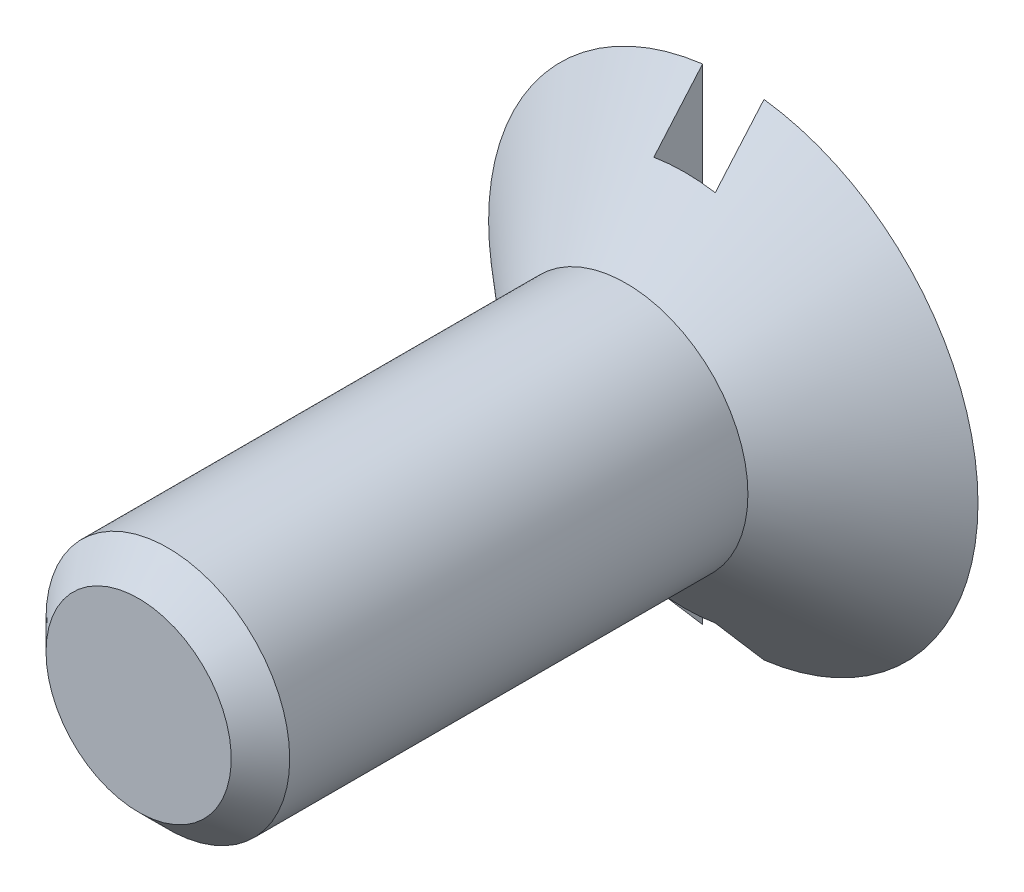
ISO-10303-21;
HEADER;
FILE_DESCRIPTION(('STEP AP214'),'2;1');
FILE_NAME('part.step','',(''),(''),'','','');
FILE_SCHEMA(('AUTOMOTIVE_DESIGN { 1 0 10303 214 1 1 1 1 }'));
ENDSEC;
DATA;
#1=APPLICATION_CONTEXT('core data for automotive mechanical design processes');
#2=APPLICATION_PROTOCOL_DEFINITION('international standard','automotive_design',2000,#1);
#3=PRODUCT_CONTEXT('',#1,'mechanical');
#4=PRODUCT('Part','Part','',(#3));
#5=PRODUCT_RELATED_PRODUCT_CATEGORY('part','',(#4));
#6=PRODUCT_DEFINITION_FORMATION('','',#4);
#7=PRODUCT_DEFINITION_CONTEXT('part definition',#1,'design');
#8=PRODUCT_DEFINITION('design','',#6,#7);
#9=PRODUCT_DEFINITION_SHAPE('','',#8);
#10=(LENGTH_UNIT() NAMED_UNIT(*) SI_UNIT(.MILLI.,.METRE.));
#11=(NAMED_UNIT(*) PLANE_ANGLE_UNIT() SI_UNIT($,.RADIAN.));
#12=(NAMED_UNIT(*) SI_UNIT($,.STERADIAN.) SOLID_ANGLE_UNIT());
#13=UNCERTAINTY_MEASURE_WITH_UNIT(LENGTH_MEASURE(1.E-05),#10,'distance_accuracy_value','');
#14=(GEOMETRIC_REPRESENTATION_CONTEXT(3) GLOBAL_UNCERTAINTY_ASSIGNED_CONTEXT((#13)) GLOBAL_UNIT_ASSIGNED_CONTEXT((#10,
#11,#12)) REPRESENTATION_CONTEXT('',''));
#15=CARTESIAN_POINT('',(0.,0.,0.));
#16=DIRECTION('',(0.,0.,1.));
#17=DIRECTION('',(1.,0.,0.));
#18=AXIS2_PLACEMENT_3D('',#15,#16,#17);
#19=CARTESIAN_POINT('',(0.,0.,-14.732));
#20=DIRECTION('',(0.,0.,1.));
#21=DIRECTION('',(1.,0.,0.));
#22=AXIS2_PLACEMENT_3D('',#19,#20,#21);
#23=PLANE('',#22);
#24=CARTESIAN_POINT('',(0.,0.,-14.732));
#25=DIRECTION('',(0.,0.,-1.));
#26=DIRECTION('',(-1.,0.,0.));
#27=AXIS2_PLACEMENT_3D('',#24,#25,#26);
#28=CIRCLE('',#27,6.3754);
#29=CARTESIAN_POINT('',(0.800099999999999,6.32499526877293,-14.732));
#30=VERTEX_POINT('',#29);
#31=CARTESIAN_POINT('',(0.800099999999999,-6.32499526877293,-14.732));
#32=VERTEX_POINT('',#31);
#33=EDGE_CURVE('E109',#30,#32,#28,.T.);
#34=ORIENTED_EDGE('',*,*,#33,.T.);
#35=DIRECTION('',(0.,1.,0.));
#36=VECTOR('',#35,1.);
#37=CARTESIAN_POINT('',(0.800099999999999,0.,-14.732));
#38=LINE('',#37,#36);
#39=EDGE_CURVE('E95',#32,#30,#38,.T.);
#40=ORIENTED_EDGE('',*,*,#39,.T.);
#41=EDGE_LOOP('',(#34,#40));
#42=FACE_BOUND('',#41,.T.);
#43=ADVANCED_FACE('F45',(#42),#23,.F.);
#44=CARTESIAN_POINT('',(0.,0.,0.762));
#45=DIRECTION('',(0.,0.,-1.));
#46=DIRECTION('',(-1.,0.,0.));
#47=AXIS2_PLACEMENT_3D('',#44,#45,#46);
#48=PLANE('',#47);
#49=CARTESIAN_POINT('',(0.,0.,0.762));
#50=DIRECTION('',(0.,0.,-1.));
#51=DIRECTION('',(-1.,0.,0.));
#52=AXIS2_PLACEMENT_3D('',#49,#50,#51);
#53=CIRCLE('',#52,2.413);
#54=CARTESIAN_POINT('',(-2.413,0.,0.762000000000001));
#55=VERTEX_POINT('',#54);
#56=EDGE_CURVE('E96',#55,#55,#53,.T.);
#57=ORIENTED_EDGE('',*,*,#56,.F.);
#58=EDGE_LOOP('',(#57));
#59=FACE_BOUND('',#58,.T.);
#60=ADVANCED_FACE('F47',(#59),#48,.F.);
#61=CARTESIAN_POINT('',(0.,0.,0.762));
#62=DIRECTION('',(0.,0.,-1.));
#63=DIRECTION('',(-1.,0.,0.));
#64=AXIS2_PLACEMENT_3D('',#61,#62,#63);
#65=CONICAL_SURFACE('',#64,2.413,0.785398163397448);
#66=CARTESIAN_POINT('',(0.,0.,0.));
#67=DIRECTION('',(0.,0.,-1.));
#68=DIRECTION('',(-1.,0.,0.));
#69=AXIS2_PLACEMENT_3D('',#66,#67,#68);
#70=CIRCLE('',#69,3.175);
#71=CARTESIAN_POINT('',(-3.175,0.,0.));
#72=VERTEX_POINT('',#71);
#73=EDGE_CURVE('E127',#72,#72,#70,.T.);
#74=ORIENTED_EDGE('',*,*,#73,.F.);
#75=EDGE_LOOP('',(#74));
#76=FACE_BOUND('',#75,.T.);
#77=ORIENTED_EDGE('',*,*,#56,.T.);
#78=EDGE_LOOP('',(#77));
#79=FACE_BOUND('',#78,.T.);
#80=ADVANCED_FACE('F170',(#76,#79),#65,.T.);
#81=CARTESIAN_POINT('',(0.,0.,0.));
#82=DIRECTION('',(0.,0.,-1.));
#83=DIRECTION('',(-1.,0.,0.));
#84=AXIS2_PLACEMENT_3D('',#81,#82,#83);
#85=CYLINDRICAL_SURFACE('',#84,3.175);
#86=CARTESIAN_POINT('',(0.,0.,-11.938));
#87=DIRECTION('',(0.,0.,-1.));
#88=DIRECTION('',(-1.,0.,0.));
#89=AXIS2_PLACEMENT_3D('',#86,#87,#88);
#90=CIRCLE('',#89,3.175);
#91=CARTESIAN_POINT('',(-3.175,0.,-11.938));
#92=VERTEX_POINT('',#91);
#93=EDGE_CURVE('E115',#92,#92,#90,.T.);
#94=ORIENTED_EDGE('',*,*,#93,.F.);
#95=EDGE_LOOP('',(#94));
#96=FACE_BOUND('',#95,.T.);
#97=ORIENTED_EDGE('',*,*,#73,.T.);
#98=EDGE_LOOP('',(#97));
#99=FACE_BOUND('',#98,.T.);
#100=ADVANCED_FACE('F164',(#96,#99),#85,.T.);
#101=CARTESIAN_POINT('',(0.,0.,-11.938));
#102=DIRECTION('',(0.,0.,-1.));
#103=DIRECTION('',(-1.,0.,0.));
#104=AXIS2_PLACEMENT_3D('',#101,#102,#103);
#105=CONICAL_SURFACE('',#104,3.175,0.853091186091417);
#106=ORIENTED_EDGE('',*,*,#33,.F.);
#107=CARTESIAN_POINT('',(0.800099999999999,6.32580347593767,-14.7327));
#108=CARTESIAN_POINT('',(0.800099999999999,6.1350911102928,-14.5675276157535));
#109=CARTESIAN_POINT('',(0.800099999999999,5.94432658738175,-14.4024153340247));
#110=CARTESIAN_POINT('',(0.800099999999999,5.56253051638648,-14.0722744607531));
#111=CARTESIAN_POINT('',(0.800099999999999,5.37149887743578,-13.9072459743051));
#112=CARTESIAN_POINT('',(0.800099999999999,4.98729805628863,-13.5757636852163));
#113=CARTESIAN_POINT('',(0.800099999999999,4.79412677065173,-13.4093123198955));
#114=CARTESIAN_POINT('',(0.800099999999999,4.40759712808195,-13.0768538440223));
#115=CARTESIAN_POINT('',(0.800099999999999,4.21423894480533,-12.9108465316911));
#116=CARTESIAN_POINT('',(0.800099999999999,3.88609902167886,-12.6298852956792));
#117=CARTESIAN_POINT('',(0.800099999999999,3.75143205353932,-12.5147973725678));
#118=CARTESIAN_POINT('',(0.800099999999999,3.48179604451513,-12.2849574065976));
#119=CARTESIAN_POINT('',(0.800099999999999,3.34682698394695,-12.1702053868202));
#120=CARTESIAN_POINT('',(0.800099999999999,3.0762035102806,-11.9409524065854));
#121=CARTESIAN_POINT('',(0.800099999999999,2.94054826160192,-11.826452431327));
#122=CARTESIAN_POINT('',(0.800099999999999,2.6686670130199,-11.5982018821313));
#123=CARTESIAN_POINT('',(0.800099999999999,2.53244116658283,-11.4844511255103));
#124=CARTESIAN_POINT('',(0.800099999999999,2.26018766166667,-11.2589987055352));
#125=CARTESIAN_POINT('',(0.8001,2.12416762328818,-11.1472878807357));
#126=CARTESIAN_POINT('',(0.8001,1.91892563710222,-10.9810809771517));
#127=CARTESIAN_POINT('',(0.8001,1.8502760785416,-10.9258788001487));
#128=CARTESIAN_POINT('',(0.8001,1.71246059933502,-10.8161235822177));
#129=CARTESIAN_POINT('',(0.8001,1.64329468711566,-10.761570530734));
#130=CARTESIAN_POINT('',(0.8001,1.50452493200105,-10.6535766468475));
#131=CARTESIAN_POINT('',(0.8001,1.43492379485737,-10.6001323449351));
#132=CARTESIAN_POINT('',(0.8001,1.29473999819658,-10.4945506174997));
#133=CARTESIAN_POINT('',(0.8001,1.22415742667035,-10.4424130759782));
#134=CARTESIAN_POINT('',(0.8001,1.08166417462031,-10.3402124271408));
#135=CARTESIAN_POINT('',(0.8001,1.00975566800898,-10.2901462969425));
#136=CARTESIAN_POINT('',(0.8001,0.863806777665605,-10.1932396705019));
#137=CARTESIAN_POINT('',(0.8001,0.78976786482284,-10.1463970210307));
#138=CARTESIAN_POINT('',(0.8001,0.69791338934671,-10.0930126433937));
#139=CARTESIAN_POINT('',(0.8001,0.681679496793845,-10.0837514789452));
#140=CARTESIAN_POINT('',(0.8001,0.649040722593413,-10.0655315547878));
#141=CARTESIAN_POINT('',(0.8001,0.632635822907809,-10.0565728274116));
#142=CARTESIAN_POINT('',(0.8001,0.583145318804708,-10.0302107368661));
#143=CARTESIAN_POINT('',(0.8001,0.549782949487993,-10.0133209015437));
#144=CARTESIAN_POINT('',(0.8001,0.482389498874077,-9.98143483124675));
#145=CARTESIAN_POINT('',(0.8001,0.448363426951334,-9.96642816784403));
#146=CARTESIAN_POINT('',(0.8001,0.379378482674707,-9.93875470793273));
#147=CARTESIAN_POINT('',(0.8001,0.344419722902814,-9.92608763046898));
#148=CARTESIAN_POINT('',(0.8001,0.255134012572184,-9.89802734879697));
#149=CARTESIAN_POINT('',(0.8001,0.200133759432043,-9.8846080098549));
#150=CARTESIAN_POINT('',(0.8001,0.116651021185976,-9.87165317319895));
#151=CARTESIAN_POINT('',(0.8001,0.0887097816501752,-9.86852981704503));
#152=CARTESIAN_POINT('',(0.8001,0.0326532705638041,-9.86483145161933));
#153=CARTESIAN_POINT('',(0.8001,0.0045380088365507,-9.86425629979516));
#154=CARTESIAN_POINT('',(0.8001,-0.0516660645911417,-9.86569864059976));
#155=CARTESIAN_POINT('',(0.8001,-0.0797547725033989,-9.86772004344284));
#156=CARTESIAN_POINT('',(0.8001,-0.135646329422128,-9.87422884672379));
#157=CARTESIAN_POINT('',(0.8001,-0.163449109978496,-9.87871682426833));
#158=CARTESIAN_POINT('',(0.8001,-0.218721240373384,-9.88992105509959));
#159=CARTESIAN_POINT('',(0.8001,-0.246188604418199,-9.8966469517158));
#160=CARTESIAN_POINT('',(0.8001,-0.300577465608555,-9.9120010520031));
#161=CARTESIAN_POINT('',(0.8001,-0.327498972815586,-9.92062922057574));
#162=CARTESIAN_POINT('',(0.8001,-0.426344286138618,-9.95554061343869));
#163=CARTESIAN_POINT('',(0.8001,-0.496504162441252,-9.98678519090332));
#164=CARTESIAN_POINT('',(0.8001,-0.633558988737868,-10.0558025036695));
#165=CARTESIAN_POINT('',(0.8001,-0.700444222160577,-10.0935933157913));
#166=CARTESIAN_POINT('',(0.8001,-0.832438606153997,-10.1733027046146));
#167=CARTESIAN_POINT('',(0.8001,-0.897528665777201,-10.215252624189));
#168=CARTESIAN_POINT('',(0.8001,-0.993894366673517,-10.2799363820698));
#169=CARTESIAN_POINT('',(0.8001,-1.02578344129142,-10.3017753293111));
#170=CARTESIAN_POINT('',(0.8001,-1.08922173993811,-10.3459408399712));
#171=CARTESIAN_POINT('',(0.8001,-1.12077097477652,-10.3682673878116));
#172=CARTESIAN_POINT('',(0.800099999999999,-1.22537953781258,-10.4432750517358));
#173=CARTESIAN_POINT('',(0.8001,-1.29781855902914,-10.4968197382529));
#174=CARTESIAN_POINT('',(0.8001,-1.44167386114809,-10.6052689827849));
#175=CARTESIAN_POINT('',(0.8001,-1.51309004491303,-10.6601736686231));
#176=CARTESIAN_POINT('',(0.8001,-1.65521580318623,-10.7709271459784));
#177=CARTESIAN_POINT('',(0.8001,-1.72592518404309,-10.8267761855292));
#178=CARTESIAN_POINT('',(0.8001,-1.86681562147361,-10.93913751672));
#179=CARTESIAN_POINT('',(0.8001,-1.93699666907475,-10.9956498195824));
#180=CARTESIAN_POINT('',(0.8001,-2.1471219080533,-11.1660419993671));
#181=CARTESIAN_POINT('',(0.800099999999999,-2.28647968720083,-11.2806442963367));
#182=CARTESIAN_POINT('',(0.800099999999999,-2.56424595624096,-11.5109431109032));
#183=CARTESIAN_POINT('',(0.800099999999999,-2.70265459608562,-11.6266394484484));
#184=CARTESIAN_POINT('',(0.800099999999999,-2.97804883084463,-11.8580591705755));
#185=CARTESIAN_POINT('',(0.800099999999999,-3.11503799478169,-11.9737783103583));
#186=CARTESIAN_POINT('',(0.800099999999999,-3.38861485747297,-12.2057012139997));
#187=CARTESIAN_POINT('',(0.800099999999999,-3.52520253914406,-12.3219049979853));
#188=CARTESIAN_POINT('',(0.800099999999999,-3.93439743419738,-12.6708961527176));
#189=CARTESIAN_POINT('',(0.800099999999999,-4.2065783910393,-12.9041831500499));
#190=CARTESIAN_POINT('',(0.800099999999999,-4.6324251102168,-13.2701688101472));
#191=CARTESIAN_POINT('',(0.800099999999999,-4.78630387808614,-13.4026201711534));
#192=CARTESIAN_POINT('',(0.800099999999999,-5.09392518612701,-13.6677224655622));
#193=CARTESIAN_POINT('',(0.800099999999999,-5.2476677054314,-13.80037342319));
#194=CARTESIAN_POINT('',(0.800099999999999,-5.55554026261048,-14.0662501381928));
#195=CARTESIAN_POINT('',(0.800099999999999,-5.70966990836921,-14.1994763494324));
#196=CARTESIAN_POINT('',(0.800099999999999,-6.01781278201417,-14.4660212853492));
#197=CARTESIAN_POINT('',(0.800099999999999,-6.17182602281726,-14.5993399950929));
#198=CARTESIAN_POINT('',(0.800099999999999,-6.32580347593767,-14.7327));
#199=B_SPLINE_CURVE_WITH_KNOTS('',3,(#107,#108,#109,#110,#111,#112,#113,#114,#115,#116,#117,
#118,#119,#120,#121,#122,#123,#124,#125,#126,#127,#128,#129,#130,#131,#132,#133,#134,#135,#136,
#137,#138,#139,#140,#141,#142,#143,#144,#145,#146,#147,#148,#149,#150,#151,#152,#153,#154,#155,
#156,#157,#158,#159,#160,#161,#162,#163,#164,#165,#166,#167,#168,#169,#170,#171,#172,#173,#174,
#175,#176,#177,#178,#179,#180,#181,#182,#183,#184,#185,#186,#187,#188,#189,#190,#191,#192,#193,
#194,#195,#196,#197,#198),.UNSPECIFIED.,.F.,.F.,(4,2,2,2,2,2,2,2,2,2,2,2,2,2,2,2,2,2,2,2,2,2,2,
2,2,2,2,2,2,2,2,2,2,2,2,2,2,2,2,2,2,2,2,2,2,4),(0.,0.756887223904298,1.51421621601934,
2.27919361882738,3.04372701463034,3.57516220299197,4.10663308954762,4.63918483789042,
5.17160153162618,5.6996301335219,5.96390079134653,6.22816714581044,6.49141757121121,
6.75464454505279,7.01747275999147,7.28012367095839,7.33619014579954,7.39226259567865,
7.50440415832684,7.61589439354163,7.72737123144907,7.89645474102975,7.98070028412561,
8.0649411142739,8.1493089535704,8.23369654089337,8.31845257318209,8.40320704178514,
8.63288567645957,8.86320896356818,9.09542328245649,9.2113728072124,9.32731863289493,
9.5975305881424,9.86776803712028,10.1380776015892,10.4083917463328,10.9496637088041,
11.4908480902846,12.0288170811332,12.5668086405335,13.6422346100623,14.2513309516196,
14.8605083954183,15.4716928873262,16.0827947919835),.UNSPECIFIED.);
#200=CARTESIAN_POINT('',(0.800099999999999,4.85518898488263,-13.462));
#201=VERTEX_POINT('',#200);
#202=EDGE_CURVE('E110',#30,#201,#199,.T.);
#203=ORIENTED_EDGE('',*,*,#202,.T.);
#204=CARTESIAN_POINT('',(0.,0.,-13.462));
#205=DIRECTION('',(0.,0.,1.));
#206=DIRECTION('',(1.,0.,0.));
#207=AXIS2_PLACEMENT_3D('',#204,#205,#206);
#208=CIRCLE('',#207,4.92067272727273);
#209=CARTESIAN_POINT('',(-0.800100000000001,4.85518898488263,-13.462));
#210=VERTEX_POINT('',#209);
#211=EDGE_CURVE('E11',#201,#210,#208,.T.);
#212=ORIENTED_EDGE('',*,*,#211,.T.);
#213=CARTESIAN_POINT('',(-0.800100000000004,-6.32580347593767,-14.7327));
#214=CARTESIAN_POINT('',(-0.800100000000004,-6.1350911102928,-14.5675276157535));
#215=CARTESIAN_POINT('',(-0.800100000000004,-5.94432658738175,-14.4024153340247));
#216=CARTESIAN_POINT('',(-0.800100000000004,-5.56253051638647,-14.0722744607531));
#217=CARTESIAN_POINT('',(-0.800100000000004,-5.37149887743578,-13.9072459743051));
#218=CARTESIAN_POINT('',(-0.800100000000004,-4.98729805628863,-13.5757636852163));
#219=CARTESIAN_POINT('',(-0.800100000000004,-4.79412677065172,-13.4093123198955));
#220=CARTESIAN_POINT('',(-0.800100000000004,-4.40759712808194,-13.0768538440222));
#221=CARTESIAN_POINT('',(-0.800100000000004,-4.21423894480532,-12.9108465316911));
#222=CARTESIAN_POINT('',(-0.800100000000004,-3.88609902167885,-12.6298852956792));
#223=CARTESIAN_POINT('',(-0.800100000000004,-3.75143205353931,-12.5147973725678));
#224=CARTESIAN_POINT('',(-0.800100000000003,-3.48179604451512,-12.2849574065976));
#225=CARTESIAN_POINT('',(-0.800100000000003,-3.34682698394694,-12.1702053868202));
#226=CARTESIAN_POINT('',(-0.800100000000003,-3.07620351028059,-11.9409524065854));
#227=CARTESIAN_POINT('',(-0.800100000000003,-2.94054826160191,-11.826452431327));
#228=CARTESIAN_POINT('',(-0.800100000000003,-2.66866701301989,-11.5982018821313));
#229=CARTESIAN_POINT('',(-0.800100000000003,-2.53244116658283,-11.4844511255103));
#230=CARTESIAN_POINT('',(-0.800100000000003,-2.26018766166666,-11.2589987055352));
#231=CARTESIAN_POINT('',(-0.800100000000003,-2.12416762328818,-11.1472878807357));
#232=CARTESIAN_POINT('',(-0.800100000000003,-1.91892563710221,-10.9810809771517));
#233=CARTESIAN_POINT('',(-0.800100000000003,-1.8502760785416,-10.9258788001487));
#234=CARTESIAN_POINT('',(-0.800100000000003,-1.71246059933502,-10.8161235822177));
#235=CARTESIAN_POINT('',(-0.800100000000003,-1.64329468711565,-10.761570530734));
#236=CARTESIAN_POINT('',(-0.800100000000003,-1.50452493200104,-10.6535766468475));
#237=CARTESIAN_POINT('',(-0.800100000000003,-1.43492379485737,-10.6001323449351));
#238=CARTESIAN_POINT('',(-0.800100000000003,-1.29473999819658,-10.4945506174997));
#239=CARTESIAN_POINT('',(-0.800100000000003,-1.22415742667035,-10.4424130759782));
#240=CARTESIAN_POINT('',(-0.800100000000003,-1.08166417462031,-10.3402124271408));
#241=CARTESIAN_POINT('',(-0.800100000000003,-1.00975566800899,-10.2901462969425));
#242=CARTESIAN_POINT('',(-0.800100000000003,-0.863806777665606,-10.1932396705019));
#243=CARTESIAN_POINT('',(-0.800100000000002,-0.78976786482284,-10.1463970210307));
#244=CARTESIAN_POINT('',(-0.800100000000002,-0.69791338934671,-10.0930126433937));
#245=CARTESIAN_POINT('',(-0.800100000000002,-0.681679496793845,-10.0837514789452));
#246=CARTESIAN_POINT('',(-0.800100000000002,-0.649040722593413,-10.0655315547878));
#247=CARTESIAN_POINT('',(-0.800100000000002,-0.632635822907809,-10.0565728274116));
#248=CARTESIAN_POINT('',(-0.800100000000002,-0.583145318804707,-10.0302107368661));
#249=CARTESIAN_POINT('',(-0.800100000000002,-0.549782949487992,-10.0133209015437));
#250=CARTESIAN_POINT('',(-0.800100000000002,-0.482389498874077,-9.98143483124675));
#251=CARTESIAN_POINT('',(-0.800100000000002,-0.448363426951333,-9.96642816784403));
#252=CARTESIAN_POINT('',(-0.800100000000002,-0.379378482674706,-9.93875470793273));
#253=CARTESIAN_POINT('',(-0.800100000000002,-0.344419722902814,-9.92608763046898));
#254=CARTESIAN_POINT('',(-0.800100000000002,-0.255134012572184,-9.89802734879697));
#255=CARTESIAN_POINT('',(-0.800100000000002,-0.200133759432042,-9.8846080098549));
#256=CARTESIAN_POINT('',(-0.800100000000002,-0.116651021185976,-9.87165317319895));
#257=CARTESIAN_POINT('',(-0.800100000000002,-0.0887097816501746,-9.86852981704503));
#258=CARTESIAN_POINT('',(-0.800100000000002,-0.0326532705638035,-9.86483145161933));
#259=CARTESIAN_POINT('',(-0.800100000000002,-0.00453800883655021,-9.86425629979516));
#260=CARTESIAN_POINT('',(-0.800100000000002,0.0516660645911416,-9.86569864059976));
#261=CARTESIAN_POINT('',(-0.800100000000002,0.0797547725033983,-9.86772004344284));
#262=CARTESIAN_POINT('',(-0.800100000000002,0.135646329422127,-9.87422884672379));
#263=CARTESIAN_POINT('',(-0.800100000000002,0.163449109978495,-9.87871682426833));
#264=CARTESIAN_POINT('',(-0.800100000000002,0.218721240373383,-9.88992105509959));
#265=CARTESIAN_POINT('',(-0.800100000000002,0.246188604418198,-9.8966469517158));
#266=CARTESIAN_POINT('',(-0.800100000000002,0.300577465608555,-9.9120010520031));
#267=CARTESIAN_POINT('',(-0.800100000000002,0.327498972815586,-9.92062922057574));
#268=CARTESIAN_POINT('',(-0.800100000000002,0.426344286138618,-9.95554061343869));
#269=CARTESIAN_POINT('',(-0.800100000000002,0.496504162441252,-9.98678519090332));
#270=CARTESIAN_POINT('',(-0.800100000000002,0.633558988737869,-10.0558025036695));
#271=CARTESIAN_POINT('',(-0.800100000000002,0.700444222160579,-10.0935933157913));
#272=CARTESIAN_POINT('',(-0.800100000000002,0.832438606153999,-10.1733027046146));
#273=CARTESIAN_POINT('',(-0.800100000000002,0.897528665777202,-10.215252624189));
#274=CARTESIAN_POINT('',(-0.800100000000002,0.993894366673517,-10.2799363820698));
#275=CARTESIAN_POINT('',(-0.800100000000002,1.02578344129142,-10.3017753293111));
#276=CARTESIAN_POINT('',(-0.800100000000002,1.08922173993811,-10.3459408399712));
#277=CARTESIAN_POINT('',(-0.800100000000002,1.12077097477652,-10.3682673878116));
#278=CARTESIAN_POINT('',(-0.800100000000002,1.22537953781258,-10.4432750517358));
#279=CARTESIAN_POINT('',(-0.800100000000002,1.29781855902914,-10.4968197382529));
#280=CARTESIAN_POINT('',(-0.800100000000002,1.44167386114809,-10.6052689827849));
#281=CARTESIAN_POINT('',(-0.800100000000002,1.51309004491303,-10.6601736686231));
#282=CARTESIAN_POINT('',(-0.800100000000002,1.65521580318623,-10.7709271459784));
#283=CARTESIAN_POINT('',(-0.800100000000002,1.72592518404309,-10.8267761855292));
#284=CARTESIAN_POINT('',(-0.800100000000002,1.86681562147361,-10.93913751672));
#285=CARTESIAN_POINT('',(-0.800100000000002,1.93699666907475,-10.9956498195824));
#286=CARTESIAN_POINT('',(-0.800100000000002,2.1471219080533,-11.1660419993671));
#287=CARTESIAN_POINT('',(-0.800100000000002,2.28647968720083,-11.2806442963367));
#288=CARTESIAN_POINT('',(-0.800100000000002,2.56424595624096,-11.5109431109032));
#289=CARTESIAN_POINT('',(-0.800100000000002,2.70265459608562,-11.6266394484484));
#290=CARTESIAN_POINT('',(-0.800100000000002,2.97804883084463,-11.8580591705755));
#291=CARTESIAN_POINT('',(-0.800100000000002,3.1150379947817,-11.9737783103583));
#292=CARTESIAN_POINT('',(-0.800100000000002,3.38861485747297,-12.2057012139997));
#293=CARTESIAN_POINT('',(-0.800100000000002,3.52520253914406,-12.3219049979853));
#294=CARTESIAN_POINT('',(-0.800100000000001,3.93439743419738,-12.6708961527176));
#295=CARTESIAN_POINT('',(-0.800100000000002,4.2065783910393,-12.9041831500499));
#296=CARTESIAN_POINT('',(-0.800100000000001,4.6324251102168,-13.2701688101472));
#297=CARTESIAN_POINT('',(-0.800100000000001,4.78630387808614,-13.4026201711534));
#298=CARTESIAN_POINT('',(-0.800100000000001,5.09392518612701,-13.6677224655622));
#299=CARTESIAN_POINT('',(-0.800100000000001,5.2476677054314,-13.80037342319));
#300=CARTESIAN_POINT('',(-0.800100000000001,5.55554026261048,-14.0662501381928));
#301=CARTESIAN_POINT('',(-0.800100000000001,5.70966990836921,-14.1994763494324));
#302=CARTESIAN_POINT('',(-0.800100000000001,6.01781278201417,-14.4660212853492));
#303=CARTESIAN_POINT('',(-0.800100000000001,6.17182602281727,-14.5993399950929));
#304=CARTESIAN_POINT('',(-0.800100000000001,6.32580347593767,-14.7327));
#305=B_SPLINE_CURVE_WITH_KNOTS('',3,(#213,#214,#215,#216,#217,#218,#219,#220,#221,#222,#223,
#224,#225,#226,#227,#228,#229,#230,#231,#232,#233,#234,#235,#236,#237,#238,#239,#240,#241,#242,
#243,#244,#245,#246,#247,#248,#249,#250,#251,#252,#253,#254,#255,#256,#257,#258,#259,#260,#261,
#262,#263,#264,#265,#266,#267,#268,#269,#270,#271,#272,#273,#274,#275,#276,#277,#278,#279,#280,
#281,#282,#283,#284,#285,#286,#287,#288,#289,#290,#291,#292,#293,#294,#295,#296,#297,#298,#299,
#300,#301,#302,#303,#304),.UNSPECIFIED.,.F.,.F.,(4,2,2,2,2,2,2,2,2,2,2,2,2,2,2,2,2,2,2,2,2,2,2,
2,2,2,2,2,2,2,2,2,2,2,2,2,2,2,2,2,2,2,2,2,2,4),(0.,0.7568872239043,1.51421621601934,
2.27919361882739,3.04372701463035,3.57516220299198,4.10663308954763,4.63918483789043,
5.17160153162618,5.69963013352191,5.96390079134654,6.22816714581044,6.49141757121121,
6.75464454505279,7.01747275999147,7.28012367095839,7.33619014579954,7.39226259567865,
7.50440415832684,7.61589439354163,7.72737123144907,7.89645474102975,7.98070028412561,
8.0649411142739,8.1493089535704,8.23369654089337,8.31845257318209,8.40320704178514,
8.63288567645957,8.86320896356818,9.09542328245649,9.2113728072124,9.32731863289493,
9.5975305881424,9.86776803712029,10.1380776015892,10.4083917463328,10.9496637088041,
11.4908480902846,12.0288170811332,12.5668086405335,13.6422346100623,14.2513309516196,
14.8605083954183,15.4716928873262,16.0827947919835),.UNSPECIFIED.);
#306=CARTESIAN_POINT('',(-0.800100000000001,6.32499526877294,-14.732));
#307=VERTEX_POINT('',#306);
#308=EDGE_CURVE('E89',#210,#307,#305,.T.);
#309=ORIENTED_EDGE('',*,*,#308,.T.);
#310=CARTESIAN_POINT('',(-0.800100000000004,-6.32499526877293,-14.732));
#311=VERTEX_POINT('',#310);
#312=EDGE_CURVE('E102',#311,#307,#28,.T.);
#313=ORIENTED_EDGE('',*,*,#312,.F.);
#314=CARTESIAN_POINT('',(-0.800100000000004,-4.85518898488263,-13.462));
#315=VERTEX_POINT('',#314);
#316=EDGE_CURVE('E61',#311,#315,#305,.T.);
#317=ORIENTED_EDGE('',*,*,#316,.T.);
#318=CARTESIAN_POINT('',(0.800099999999999,-4.85518898488263,-13.462));
#319=VERTEX_POINT('',#318);
#320=EDGE_CURVE('E49',#315,#319,#208,.T.);
#321=ORIENTED_EDGE('',*,*,#320,.T.);
#322=EDGE_CURVE('E69',#319,#32,#199,.T.);
#323=ORIENTED_EDGE('',*,*,#322,.T.);
#324=EDGE_LOOP('',(#106,#203,#212,#309,#313,#317,#321,#323));
#325=FACE_BOUND('',#324,.T.);
#326=ORIENTED_EDGE('',*,*,#93,.T.);
#327=EDGE_LOOP('',(#326));
#328=FACE_BOUND('',#327,.T.);
#329=ADVANCED_FACE('F100',(#325,#328),#105,.T.);
#330=ORIENTED_EDGE('',*,*,#312,.T.);
#331=DIRECTION('',(0.,-1.,0.));
#332=VECTOR('',#331,1.);
#333=CARTESIAN_POINT('',(-0.800100000000003,0.,-14.732));
#334=LINE('',#333,#332);
#335=EDGE_CURVE('E86',#307,#311,#334,.T.);
#336=ORIENTED_EDGE('',*,*,#335,.T.);
#337=EDGE_LOOP('',(#330,#336));
#338=FACE_BOUND('',#337,.T.);
#339=ADVANCED_FACE('F107',(#338),#23,.F.);
#340=CARTESIAN_POINT('',(0.,0.,-13.462));
#341=DIRECTION('',(0.,0.,1.));
#342=DIRECTION('',(1.,0.,0.));
#343=AXIS2_PLACEMENT_3D('',#340,#341,#342);
#344=PLANE('',#343);
#345=DIRECTION('',(0.,-1.,0.));
#346=VECTOR('',#345,1.);
#347=CARTESIAN_POINT('',(0.800099999999999,-6.81321237557813,-13.462));
#348=LINE('',#347,#346);
#349=EDGE_CURVE('E140',#201,#319,#348,.T.);
#350=ORIENTED_EDGE('',*,*,#349,.T.);
#351=ORIENTED_EDGE('',*,*,#320,.F.);
#352=DIRECTION('',(0.,1.,0.));
#353=VECTOR('',#352,1.);
#354=CARTESIAN_POINT('',(-0.800100000000001,7.61335603696614,-13.462));
#355=LINE('',#354,#353);
#356=EDGE_CURVE('E105',#315,#210,#355,.T.);
#357=ORIENTED_EDGE('',*,*,#356,.T.);
#358=ORIENTED_EDGE('',*,*,#211,.F.);
#359=EDGE_LOOP('',(#350,#351,#357,#358));
#360=FACE_BOUND('',#359,.T.);
#361=ADVANCED_FACE('F139',(#360),#344,.F.);
#362=CARTESIAN_POINT('',(0.800099999999999,-6.81321237557813,-13.462));
#363=DIRECTION('',(1.,0.,0.));
#364=DIRECTION('',(0.,0.,-1.));
#365=AXIS2_PLACEMENT_3D('',#362,#363,#364);
#366=PLANE('',#365);
#367=ORIENTED_EDGE('',*,*,#39,.F.);
#368=ORIENTED_EDGE('',*,*,#322,.F.);
#369=ORIENTED_EDGE('',*,*,#349,.F.);
#370=ORIENTED_EDGE('',*,*,#202,.F.);
#371=EDGE_LOOP('',(#367,#368,#369,#370));
#372=FACE_BOUND('',#371,.T.);
#373=ADVANCED_FACE('F156',(#372),#366,.F.);
#374=CARTESIAN_POINT('',(-0.800100000000001,7.61335603696614,-13.462));
#375=DIRECTION('',(-1.,0.,0.));
#376=DIRECTION('',(0.,-1.,0.));
#377=AXIS2_PLACEMENT_3D('',#374,#375,#376);
#378=PLANE('',#377);
#379=ORIENTED_EDGE('',*,*,#335,.F.);
#380=ORIENTED_EDGE('',*,*,#308,.F.);
#381=ORIENTED_EDGE('',*,*,#356,.F.);
#382=ORIENTED_EDGE('',*,*,#316,.F.);
#383=EDGE_LOOP('',(#379,#380,#381,#382));
#384=FACE_BOUND('',#383,.T.);
#385=ADVANCED_FACE('F88',(#384),#378,.F.);
#386=CLOSED_SHELL('',(#43,#60,#80,#100,#329,#339,#361,#373,#385));
#387=MANIFOLD_SOLID_BREP('B2',#386);
#388=ADVANCED_BREP_SHAPE_REPRESENTATION('',(#18,#387),#14);
#389=SHAPE_DEFINITION_REPRESENTATION(#9,#388);
ENDSEC;
END-ISO-10303-21;
